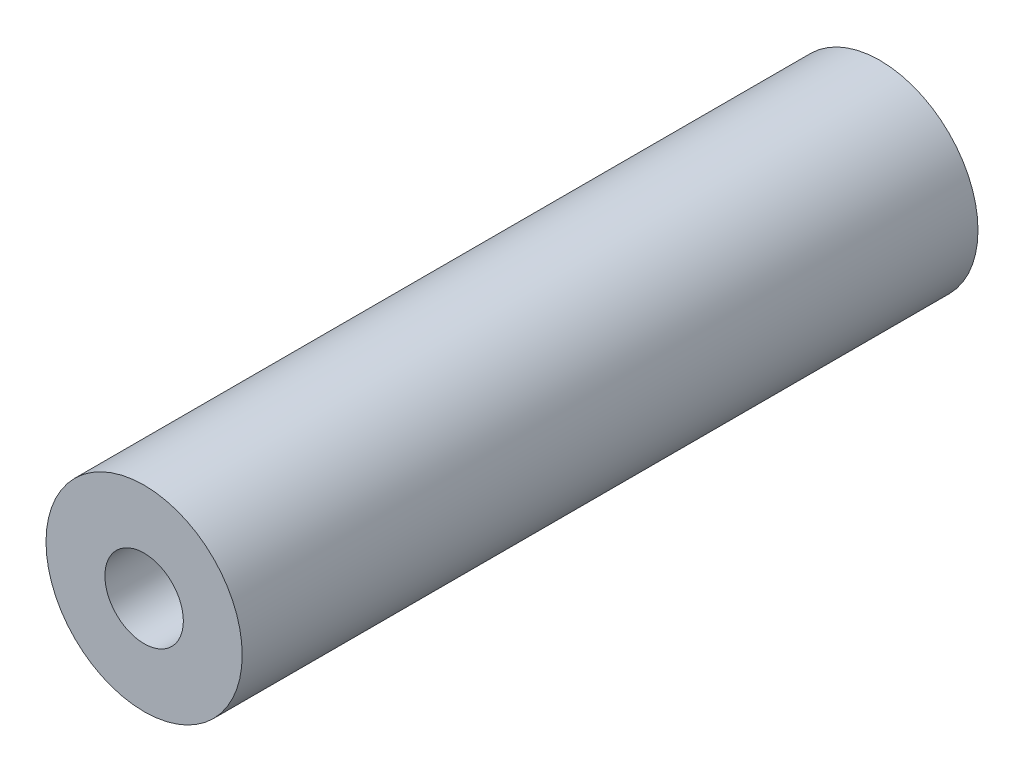
ISO-10303-21;
HEADER;
FILE_DESCRIPTION(('STEP AP214'),'2;1');
FILE_NAME('part.step','',(''),(''),'','','');
FILE_SCHEMA(('AUTOMOTIVE_DESIGN { 1 0 10303 214 1 1 1 1 }'));
ENDSEC;
DATA;
#1=APPLICATION_CONTEXT('core data for automotive mechanical design processes');
#2=APPLICATION_PROTOCOL_DEFINITION('international standard','automotive_design',2000,#1);
#3=PRODUCT_CONTEXT('',#1,'mechanical');
#4=PRODUCT('Part','Part','',(#3));
#5=PRODUCT_RELATED_PRODUCT_CATEGORY('part','',(#4));
#6=PRODUCT_DEFINITION_FORMATION('','',#4);
#7=PRODUCT_DEFINITION_CONTEXT('part definition',#1,'design');
#8=PRODUCT_DEFINITION('design','',#6,#7);
#9=PRODUCT_DEFINITION_SHAPE('','',#8);
#10=(LENGTH_UNIT() NAMED_UNIT(*) SI_UNIT(.MILLI.,.METRE.));
#11=(NAMED_UNIT(*) PLANE_ANGLE_UNIT() SI_UNIT($,.RADIAN.));
#12=(NAMED_UNIT(*) SI_UNIT($,.STERADIAN.) SOLID_ANGLE_UNIT());
#13=UNCERTAINTY_MEASURE_WITH_UNIT(LENGTH_MEASURE(1.E-05),#10,'distance_accuracy_value','');
#14=(GEOMETRIC_REPRESENTATION_CONTEXT(3) GLOBAL_UNCERTAINTY_ASSIGNED_CONTEXT((#13)) GLOBAL_UNIT_ASSIGNED_CONTEXT((#10,
#11,#12)) REPRESENTATION_CONTEXT('',''));
#15=CARTESIAN_POINT('',(0.,0.,0.));
#16=DIRECTION('',(0.,0.,1.));
#17=DIRECTION('',(1.,0.,0.));
#18=AXIS2_PLACEMENT_3D('',#15,#16,#17);
#19=CARTESIAN_POINT('',(0.,0.,18.75));
#20=DIRECTION('',(0.,0.,1.));
#21=DIRECTION('',(1.,0.,0.));
#22=AXIS2_PLACEMENT_3D('',#19,#20,#21);
#23=PLANE('',#22);
#24=CARTESIAN_POINT('',(0.,0.,18.75));
#25=DIRECTION('',(0.,0.,1.));
#26=DIRECTION('',(1.,0.,0.));
#27=AXIS2_PLACEMENT_3D('',#24,#25,#26);
#28=CIRCLE('',#27,5.);
#29=CARTESIAN_POINT('',(5.,0.,18.75));
#30=VERTEX_POINT('',#29);
#31=EDGE_CURVE('E10',#30,#30,#28,.T.);
#32=ORIENTED_EDGE('',*,*,#31,.T.);
#33=EDGE_LOOP('',(#32));
#34=FACE_BOUND('',#33,.T.);
#35=CARTESIAN_POINT('',(0.,0.,18.75));
#36=DIRECTION('',(0.,0.,1.));
#37=DIRECTION('',(1.,0.,0.));
#38=AXIS2_PLACEMENT_3D('',#35,#36,#37);
#39=CIRCLE('',#38,2.);
#40=CARTESIAN_POINT('',(2.,0.,18.75));
#41=VERTEX_POINT('',#40);
#42=EDGE_CURVE('E45',#41,#41,#39,.T.);
#43=ORIENTED_EDGE('',*,*,#42,.F.);
#44=EDGE_LOOP('',(#43));
#45=FACE_BOUND('',#44,.T.);
#46=ADVANCED_FACE('F34',(#34,#45),#23,.T.);
#47=CARTESIAN_POINT('',(0.,0.,-18.75));
#48=DIRECTION('',(0.,0.,1.));
#49=DIRECTION('',(1.,0.,0.));
#50=AXIS2_PLACEMENT_3D('',#47,#48,#49);
#51=PLANE('',#50);
#52=CARTESIAN_POINT('',(0.,0.,-18.75));
#53=DIRECTION('',(0.,0.,1.));
#54=DIRECTION('',(1.,0.,0.));
#55=AXIS2_PLACEMENT_3D('',#52,#53,#54);
#56=CIRCLE('',#55,5.);
#57=CARTESIAN_POINT('',(5.,0.,-18.75));
#58=VERTEX_POINT('',#57);
#59=EDGE_CURVE('E38',#58,#58,#56,.T.);
#60=ORIENTED_EDGE('',*,*,#59,.F.);
#61=EDGE_LOOP('',(#60));
#62=FACE_BOUND('',#61,.T.);
#63=CARTESIAN_POINT('',(0.,0.,-18.75));
#64=DIRECTION('',(0.,0.,1.));
#65=DIRECTION('',(1.,0.,0.));
#66=AXIS2_PLACEMENT_3D('',#63,#64,#65);
#67=CIRCLE('',#66,2.);
#68=CARTESIAN_POINT('',(2.,0.,-18.75));
#69=VERTEX_POINT('',#68);
#70=EDGE_CURVE('E47',#69,#69,#67,.T.);
#71=ORIENTED_EDGE('',*,*,#70,.T.);
#72=EDGE_LOOP('',(#71));
#73=FACE_BOUND('',#72,.T.);
#74=ADVANCED_FACE('F57',(#62,#73),#51,.F.);
#75=CARTESIAN_POINT('',(0.,0.,18.75));
#76=DIRECTION('',(0.,0.,-1.));
#77=DIRECTION('',(-1.,0.,0.));
#78=AXIS2_PLACEMENT_3D('',#75,#76,#77);
#79=CYLINDRICAL_SURFACE('',#78,5.);
#80=ORIENTED_EDGE('',*,*,#31,.F.);
#81=EDGE_LOOP('',(#80));
#82=FACE_BOUND('',#81,.T.);
#83=ORIENTED_EDGE('',*,*,#59,.T.);
#84=EDGE_LOOP('',(#83));
#85=FACE_BOUND('',#84,.T.);
#86=ADVANCED_FACE('F36',(#82,#85),#79,.T.);
#87=CARTESIAN_POINT('',(0.,0.,18.75));
#88=DIRECTION('',(0.,0.,-1.));
#89=DIRECTION('',(-1.,0.,0.));
#90=AXIS2_PLACEMENT_3D('',#87,#88,#89);
#91=CYLINDRICAL_SURFACE('',#90,2.);
#92=ORIENTED_EDGE('',*,*,#42,.T.);
#93=EDGE_LOOP('',(#92));
#94=FACE_BOUND('',#93,.T.);
#95=ORIENTED_EDGE('',*,*,#70,.F.);
#96=EDGE_LOOP('',(#95));
#97=FACE_BOUND('',#96,.T.);
#98=ADVANCED_FACE('F53',(#94,#97),#91,.F.);
#99=CLOSED_SHELL('',(#46,#74,#86,#98));
#100=MANIFOLD_SOLID_BREP('B2',#99);
#101=ADVANCED_BREP_SHAPE_REPRESENTATION('',(#18,#100),#14);
#102=SHAPE_DEFINITION_REPRESENTATION(#9,#101);
ENDSEC;
END-ISO-10303-21;
